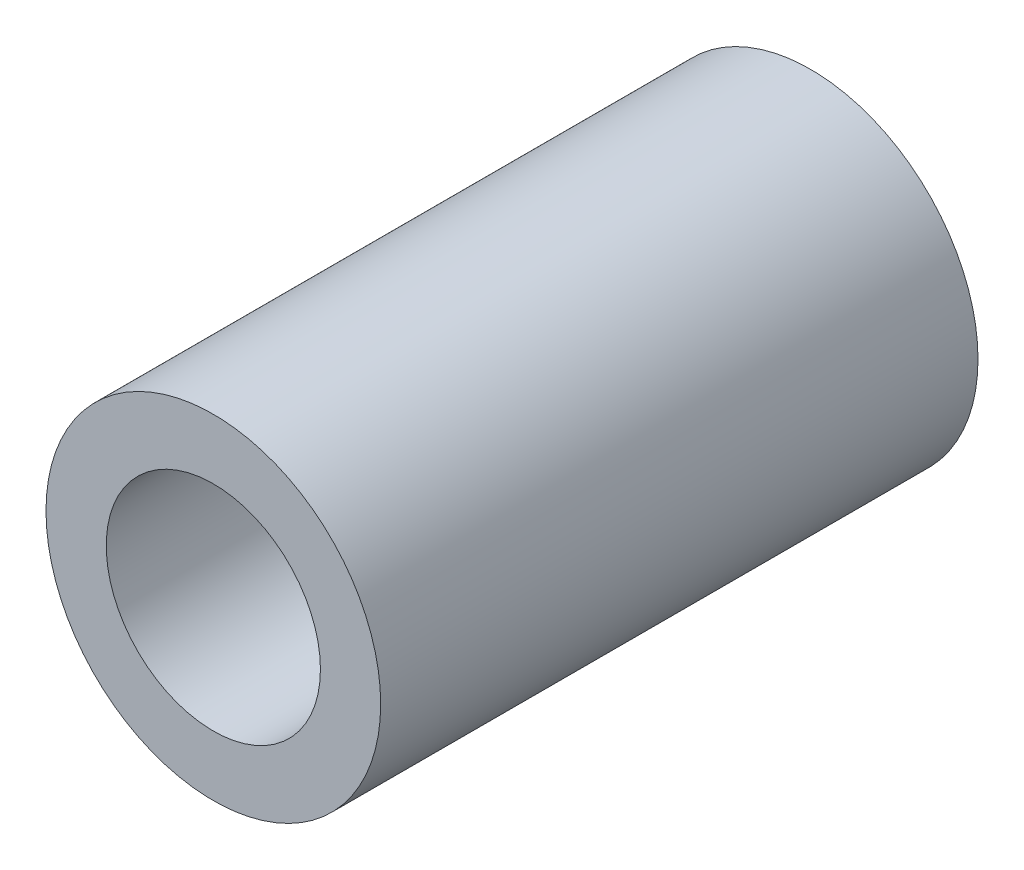
ISO-10303-21;
HEADER;
FILE_DESCRIPTION(('STEP AP214'),'2;1');
FILE_NAME('part.step','',(''),(''),'','','');
FILE_SCHEMA(('AUTOMOTIVE_DESIGN { 1 0 10303 214 1 1 1 1 }'));
ENDSEC;
DATA;
#1=APPLICATION_CONTEXT('core data for automotive mechanical design processes');
#2=APPLICATION_PROTOCOL_DEFINITION('international standard','automotive_design',2000,#1);
#3=PRODUCT_CONTEXT('',#1,'mechanical');
#4=PRODUCT('Part','Part','',(#3));
#5=PRODUCT_RELATED_PRODUCT_CATEGORY('part','',(#4));
#6=PRODUCT_DEFINITION_FORMATION('','',#4);
#7=PRODUCT_DEFINITION_CONTEXT('part definition',#1,'design');
#8=PRODUCT_DEFINITION('design','',#6,#7);
#9=PRODUCT_DEFINITION_SHAPE('','',#8);
#10=(LENGTH_UNIT() NAMED_UNIT(*) SI_UNIT(.MILLI.,.METRE.));
#11=(NAMED_UNIT(*) PLANE_ANGLE_UNIT() SI_UNIT($,.RADIAN.));
#12=(NAMED_UNIT(*) SI_UNIT($,.STERADIAN.) SOLID_ANGLE_UNIT());
#13=UNCERTAINTY_MEASURE_WITH_UNIT(LENGTH_MEASURE(1.E-05),#10,'distance_accuracy_value','');
#14=(GEOMETRIC_REPRESENTATION_CONTEXT(3) GLOBAL_UNCERTAINTY_ASSIGNED_CONTEXT((#13)) GLOBAL_UNIT_ASSIGNED_CONTEXT((#10,
#11,#12)) REPRESENTATION_CONTEXT('',''));
#15=CARTESIAN_POINT('',(0.,0.,0.));
#16=DIRECTION('',(0.,0.,1.));
#17=DIRECTION('',(1.,0.,0.));
#18=AXIS2_PLACEMENT_3D('',#15,#16,#17);
#19=CARTESIAN_POINT('',(0.,0.,17.));
#20=DIRECTION('',(0.,0.,1.));
#21=DIRECTION('',(1.,0.,0.));
#22=AXIS2_PLACEMENT_3D('',#19,#20,#21);
#23=PLANE('',#22);
#24=CARTESIAN_POINT('',(0.,0.,17.));
#25=DIRECTION('',(0.,0.,1.));
#26=DIRECTION('',(1.,0.,0.));
#27=AXIS2_PLACEMENT_3D('',#24,#25,#26);
#28=CIRCLE('',#27,4.7625);
#29=CARTESIAN_POINT('',(4.7625,0.,17.));
#30=VERTEX_POINT('',#29);
#31=EDGE_CURVE('E10',#30,#30,#28,.T.);
#32=ORIENTED_EDGE('',*,*,#31,.T.);
#33=EDGE_LOOP('',(#32));
#34=FACE_BOUND('',#33,.T.);
#35=CARTESIAN_POINT('',(0.,0.,17.));
#36=DIRECTION('',(0.,0.,1.));
#37=DIRECTION('',(1.,0.,0.));
#38=AXIS2_PLACEMENT_3D('',#35,#36,#37);
#39=CIRCLE('',#38,3.048);
#40=CARTESIAN_POINT('',(3.048,0.,17.));
#41=VERTEX_POINT('',#40);
#42=EDGE_CURVE('E50',#41,#41,#39,.T.);
#43=ORIENTED_EDGE('',*,*,#42,.F.);
#44=EDGE_LOOP('',(#43));
#45=FACE_BOUND('',#44,.T.);
#46=ADVANCED_FACE('F37',(#34,#45),#23,.T.);
#47=CARTESIAN_POINT('',(0.,0.,0.));
#48=DIRECTION('',(0.,0.,1.));
#49=DIRECTION('',(1.,0.,0.));
#50=AXIS2_PLACEMENT_3D('',#47,#48,#49);
#51=PLANE('',#50);
#52=CARTESIAN_POINT('',(0.,0.,0.));
#53=DIRECTION('',(0.,0.,1.));
#54=DIRECTION('',(1.,0.,0.));
#55=AXIS2_PLACEMENT_3D('',#52,#53,#54);
#56=CIRCLE('',#55,4.7625);
#57=CARTESIAN_POINT('',(4.7625,0.,0.));
#58=VERTEX_POINT('',#57);
#59=EDGE_CURVE('E41',#58,#58,#56,.T.);
#60=ORIENTED_EDGE('',*,*,#59,.F.);
#61=EDGE_LOOP('',(#60));
#62=FACE_BOUND('',#61,.T.);
#63=CARTESIAN_POINT('',(0.,0.,0.));
#64=DIRECTION('',(0.,0.,1.));
#65=DIRECTION('',(1.,0.,0.));
#66=AXIS2_PLACEMENT_3D('',#63,#64,#65);
#67=CIRCLE('',#66,3.048);
#68=CARTESIAN_POINT('',(3.048,0.,0.));
#69=VERTEX_POINT('',#68);
#70=EDGE_CURVE('E52',#69,#69,#67,.T.);
#71=ORIENTED_EDGE('',*,*,#70,.T.);
#72=EDGE_LOOP('',(#71));
#73=FACE_BOUND('',#72,.T.);
#74=ADVANCED_FACE('F64',(#62,#73),#51,.F.);
#75=CARTESIAN_POINT('',(0.,0.,17.));
#76=DIRECTION('',(0.,0.,-1.));
#77=DIRECTION('',(-1.,0.,0.));
#78=AXIS2_PLACEMENT_3D('',#75,#76,#77);
#79=CYLINDRICAL_SURFACE('',#78,4.7625);
#80=ORIENTED_EDGE('',*,*,#31,.F.);
#81=EDGE_LOOP('',(#80));
#82=FACE_BOUND('',#81,.T.);
#83=ORIENTED_EDGE('',*,*,#59,.T.);
#84=EDGE_LOOP('',(#83));
#85=FACE_BOUND('',#84,.T.);
#86=ADVANCED_FACE('F39',(#82,#85),#79,.T.);
#87=CARTESIAN_POINT('',(0.,0.,17.));
#88=DIRECTION('',(0.,0.,-1.));
#89=DIRECTION('',(-1.,0.,0.));
#90=AXIS2_PLACEMENT_3D('',#87,#88,#89);
#91=CYLINDRICAL_SURFACE('',#90,3.048);
#92=ORIENTED_EDGE('',*,*,#42,.T.);
#93=EDGE_LOOP('',(#92));
#94=FACE_BOUND('',#93,.T.);
#95=ORIENTED_EDGE('',*,*,#70,.F.);
#96=EDGE_LOOP('',(#95));
#97=FACE_BOUND('',#96,.T.);
#98=ADVANCED_FACE('F60',(#94,#97),#91,.F.);
#99=CLOSED_SHELL('',(#46,#74,#86,#98));
#100=MANIFOLD_SOLID_BREP('B2',#99);
#101=ADVANCED_BREP_SHAPE_REPRESENTATION('',(#18,#100),#14);
#102=SHAPE_DEFINITION_REPRESENTATION(#9,#101);
ENDSEC;
END-ISO-10303-21;
